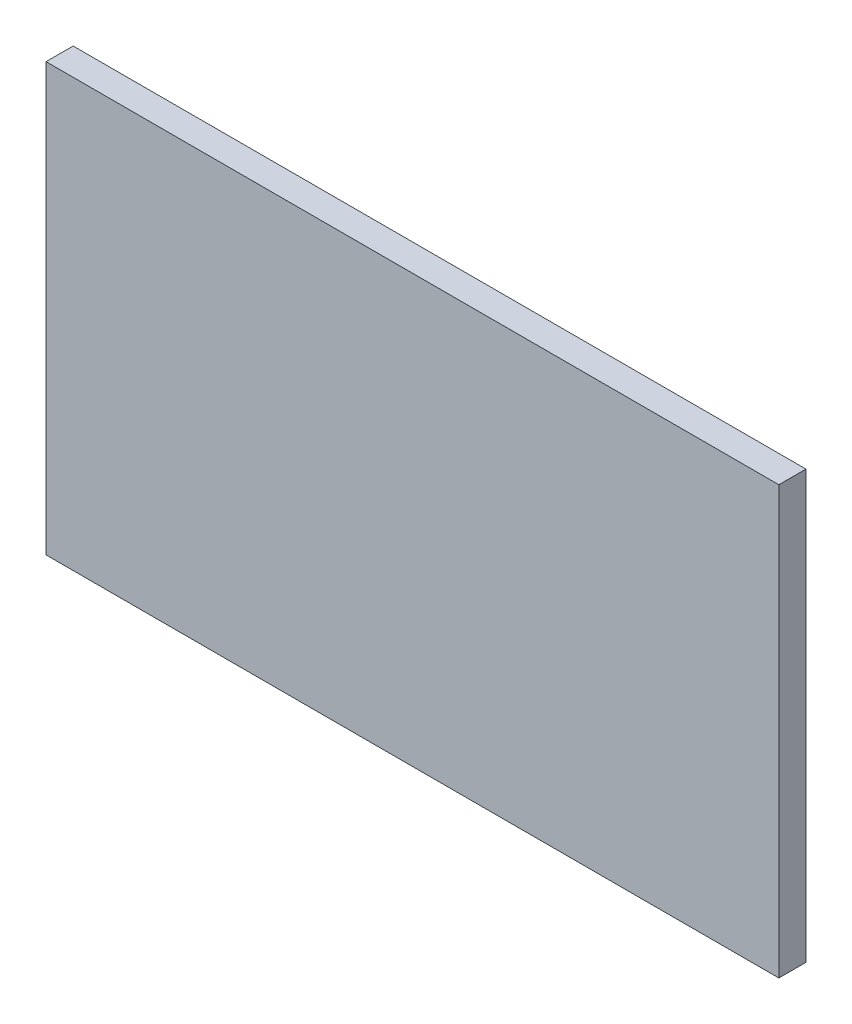
ISO-10303-21;
HEADER;
FILE_DESCRIPTION(('STEP AP214'),'2;1');
FILE_NAME('part.step','',(''),(''),'','','');
FILE_SCHEMA(('AUTOMOTIVE_DESIGN { 1 0 10303 214 1 1 1 1 }'));
ENDSEC;
DATA;
#1=APPLICATION_CONTEXT('core data for automotive mechanical design processes');
#2=APPLICATION_PROTOCOL_DEFINITION('international standard','automotive_design',2000,#1);
#3=PRODUCT_CONTEXT('',#1,'mechanical');
#4=PRODUCT('Part','Part','',(#3));
#5=PRODUCT_RELATED_PRODUCT_CATEGORY('part','',(#4));
#6=PRODUCT_DEFINITION_FORMATION('','',#4);
#7=PRODUCT_DEFINITION_CONTEXT('part definition',#1,'design');
#8=PRODUCT_DEFINITION('design','',#6,#7);
#9=PRODUCT_DEFINITION_SHAPE('','',#8);
#10=(LENGTH_UNIT() NAMED_UNIT(*) SI_UNIT(.MILLI.,.METRE.));
#11=(NAMED_UNIT(*) PLANE_ANGLE_UNIT() SI_UNIT($,.RADIAN.));
#12=(NAMED_UNIT(*) SI_UNIT($,.STERADIAN.) SOLID_ANGLE_UNIT());
#13=UNCERTAINTY_MEASURE_WITH_UNIT(LENGTH_MEASURE(1.E-05),#10,'distance_accuracy_value','');
#14=(GEOMETRIC_REPRESENTATION_CONTEXT(3) GLOBAL_UNCERTAINTY_ASSIGNED_CONTEXT((#13)) GLOBAL_UNIT_ASSIGNED_CONTEXT((#10,
#11,#12)) REPRESENTATION_CONTEXT('',''));
#15=CARTESIAN_POINT('',(0.,0.,0.));
#16=DIRECTION('',(0.,0.,1.));
#17=DIRECTION('',(1.,0.,0.));
#18=AXIS2_PLACEMENT_3D('',#15,#16,#17);
#19=CARTESIAN_POINT('',(0.,0.,3.));
#20=DIRECTION('',(1.,0.,0.));
#21=DIRECTION('',(0.,0.,-1.));
#22=AXIS2_PLACEMENT_3D('',#19,#20,#21);
#23=PLANE('',#22);
#24=DIRECTION('',(0.,-1.,0.));
#25=VECTOR('',#24,1.);
#26=CARTESIAN_POINT('',(0.,0.,0.));
#27=LINE('',#26,#25);
#28=CARTESIAN_POINT('',(0.,0.,0.));
#29=VERTEX_POINT('',#28);
#30=CARTESIAN_POINT('',(0.,-47.2659014557671,0.));
#31=VERTEX_POINT('',#30);
#32=EDGE_CURVE('E96',#29,#31,#27,.T.);
#33=ORIENTED_EDGE('',*,*,#32,.T.);
#34=DIRECTION('',(0.,0.,-1.));
#35=VECTOR('',#34,1.);
#36=CARTESIAN_POINT('',(0.,-47.2659014557671,3.));
#37=LINE('',#36,#35);
#38=CARTESIAN_POINT('',(0.,-47.2659014557671,3.));
#39=VERTEX_POINT('',#38);
#40=EDGE_CURVE('E11',#39,#31,#37,.T.);
#41=ORIENTED_EDGE('',*,*,#40,.F.);
#42=DIRECTION('',(0.,-1.,0.));
#43=VECTOR('',#42,1.);
#44=CARTESIAN_POINT('',(0.,0.,3.));
#45=LINE('',#44,#43);
#46=CARTESIAN_POINT('',(0.,0.,3.));
#47=VERTEX_POINT('',#46);
#48=EDGE_CURVE('E84',#47,#39,#45,.T.);
#49=ORIENTED_EDGE('',*,*,#48,.F.);
#50=DIRECTION('',(0.,0.,-1.));
#51=VECTOR('',#50,1.);
#52=CARTESIAN_POINT('',(0.,0.,3.));
#53=LINE('',#52,#51);
#54=EDGE_CURVE('E92',#47,#29,#53,.T.);
#55=ORIENTED_EDGE('',*,*,#54,.T.);
#56=EDGE_LOOP('',(#33,#41,#49,#55));
#57=FACE_BOUND('',#56,.T.);
#58=ADVANCED_FACE('F33',(#57),#23,.F.);
#59=CARTESIAN_POINT('',(0.,-47.2659014557671,3.));
#60=DIRECTION('',(0.,1.,0.));
#61=DIRECTION('',(0.,0.,1.));
#62=AXIS2_PLACEMENT_3D('',#59,#60,#61);
#63=PLANE('',#62);
#64=DIRECTION('',(1.,0.,0.));
#65=VECTOR('',#64,1.);
#66=CARTESIAN_POINT('',(0.,-47.2659014557671,0.));
#67=LINE('',#66,#65);
#68=CARTESIAN_POINT('',(81.0790138288618,-47.2659014557671,0.));
#69=VERTEX_POINT('',#68);
#70=EDGE_CURVE('E88',#31,#69,#67,.T.);
#71=ORIENTED_EDGE('',*,*,#70,.T.);
#72=DIRECTION('',(0.,0.,-1.));
#73=VECTOR('',#72,1.);
#74=CARTESIAN_POINT('',(81.0790138288618,-47.2659014557671,3.));
#75=LINE('',#74,#73);
#76=CARTESIAN_POINT('',(81.0790138288618,-47.2659014557671,3.));
#77=VERTEX_POINT('',#76);
#78=EDGE_CURVE('E41',#77,#69,#75,.T.);
#79=ORIENTED_EDGE('',*,*,#78,.F.);
#80=DIRECTION('',(1.,0.,0.));
#81=VECTOR('',#80,1.);
#82=CARTESIAN_POINT('',(0.,-47.2659014557671,3.));
#83=LINE('',#82,#81);
#84=EDGE_CURVE('E79',#39,#77,#83,.T.);
#85=ORIENTED_EDGE('',*,*,#84,.F.);
#86=ORIENTED_EDGE('',*,*,#40,.T.);
#87=EDGE_LOOP('',(#71,#79,#85,#86));
#88=FACE_BOUND('',#87,.T.);
#89=ADVANCED_FACE('F87',(#88),#63,.F.);
#90=CARTESIAN_POINT('',(81.0790138288618,0.,3.));
#91=DIRECTION('',(-1.,0.,0.));
#92=DIRECTION('',(0.,0.,1.));
#93=AXIS2_PLACEMENT_3D('',#90,#91,#92);
#94=PLANE('',#93);
#95=DIRECTION('',(0.,1.,0.));
#96=VECTOR('',#95,1.);
#97=CARTESIAN_POINT('',(81.0790138288618,0.,0.));
#98=LINE('',#97,#96);
#99=CARTESIAN_POINT('',(81.0790138288618,0.,0.));
#100=VERTEX_POINT('',#99);
#101=EDGE_CURVE('E66',#69,#100,#98,.T.);
#102=ORIENTED_EDGE('',*,*,#101,.T.);
#103=DIRECTION('',(0.,0.,-1.));
#104=VECTOR('',#103,1.);
#105=CARTESIAN_POINT('',(81.0790138288618,0.,3.));
#106=LINE('',#105,#104);
#107=CARTESIAN_POINT('',(81.0790138288618,0.,3.));
#108=VERTEX_POINT('',#107);
#109=EDGE_CURVE('E89',#108,#100,#106,.T.);
#110=ORIENTED_EDGE('',*,*,#109,.F.);
#111=DIRECTION('',(0.,1.,0.));
#112=VECTOR('',#111,1.);
#113=CARTESIAN_POINT('',(81.0790138288618,0.,3.));
#114=LINE('',#113,#112);
#115=EDGE_CURVE('E82',#77,#108,#114,.T.);
#116=ORIENTED_EDGE('',*,*,#115,.F.);
#117=ORIENTED_EDGE('',*,*,#78,.T.);
#118=EDGE_LOOP('',(#102,#110,#116,#117));
#119=FACE_BOUND('',#118,.T.);
#120=ADVANCED_FACE('F90',(#119),#94,.F.);
#121=CARTESIAN_POINT('',(0.,0.,3.));
#122=DIRECTION('',(0.,-1.,0.));
#123=DIRECTION('',(0.,0.,-1.));
#124=AXIS2_PLACEMENT_3D('',#121,#122,#123);
#125=PLANE('',#124);
#126=DIRECTION('',(-1.,0.,0.));
#127=VECTOR('',#126,1.);
#128=CARTESIAN_POINT('',(0.,0.,0.));
#129=LINE('',#128,#127);
#130=EDGE_CURVE('E72',#100,#29,#129,.T.);
#131=ORIENTED_EDGE('',*,*,#130,.T.);
#132=ORIENTED_EDGE('',*,*,#54,.F.);
#133=DIRECTION('',(-1.,0.,0.));
#134=VECTOR('',#133,1.);
#135=CARTESIAN_POINT('',(0.,0.,3.));
#136=LINE('',#135,#134);
#137=EDGE_CURVE('E49',#108,#47,#136,.T.);
#138=ORIENTED_EDGE('',*,*,#137,.F.);
#139=ORIENTED_EDGE('',*,*,#109,.T.);
#140=EDGE_LOOP('',(#131,#132,#138,#139));
#141=FACE_BOUND('',#140,.T.);
#142=ADVANCED_FACE('F103',(#141),#125,.F.);
#143=CARTESIAN_POINT('',(0.,0.,3.));
#144=DIRECTION('',(0.,0.,1.));
#145=DIRECTION('',(1.,0.,0.));
#146=AXIS2_PLACEMENT_3D('',#143,#144,#145);
#147=PLANE('',#146);
#148=ORIENTED_EDGE('',*,*,#48,.T.);
#149=ORIENTED_EDGE('',*,*,#84,.T.);
#150=ORIENTED_EDGE('',*,*,#115,.T.);
#151=ORIENTED_EDGE('',*,*,#137,.T.);
#152=EDGE_LOOP('',(#148,#149,#150,#151));
#153=FACE_BOUND('',#152,.T.);
#154=ADVANCED_FACE('F80',(#153),#147,.T.);
#155=CARTESIAN_POINT('',(0.,0.,0.));
#156=DIRECTION('',(0.,0.,1.));
#157=DIRECTION('',(1.,0.,0.));
#158=AXIS2_PLACEMENT_3D('',#155,#156,#157);
#159=PLANE('',#158);
#160=ORIENTED_EDGE('',*,*,#32,.F.);
#161=ORIENTED_EDGE('',*,*,#130,.F.);
#162=ORIENTED_EDGE('',*,*,#101,.F.);
#163=ORIENTED_EDGE('',*,*,#70,.F.);
#164=EDGE_LOOP('',(#160,#161,#162,#163));
#165=FACE_BOUND('',#164,.T.);
#166=ADVANCED_FACE('F106',(#165),#159,.F.);
#167=CLOSED_SHELL('',(#58,#89,#120,#142,#154,#166));
#168=MANIFOLD_SOLID_BREP('B2',#167);
#169=ADVANCED_BREP_SHAPE_REPRESENTATION('',(#18,#168),#14);
#170=SHAPE_DEFINITION_REPRESENTATION(#9,#169);
ENDSEC;
END-ISO-10303-21;
